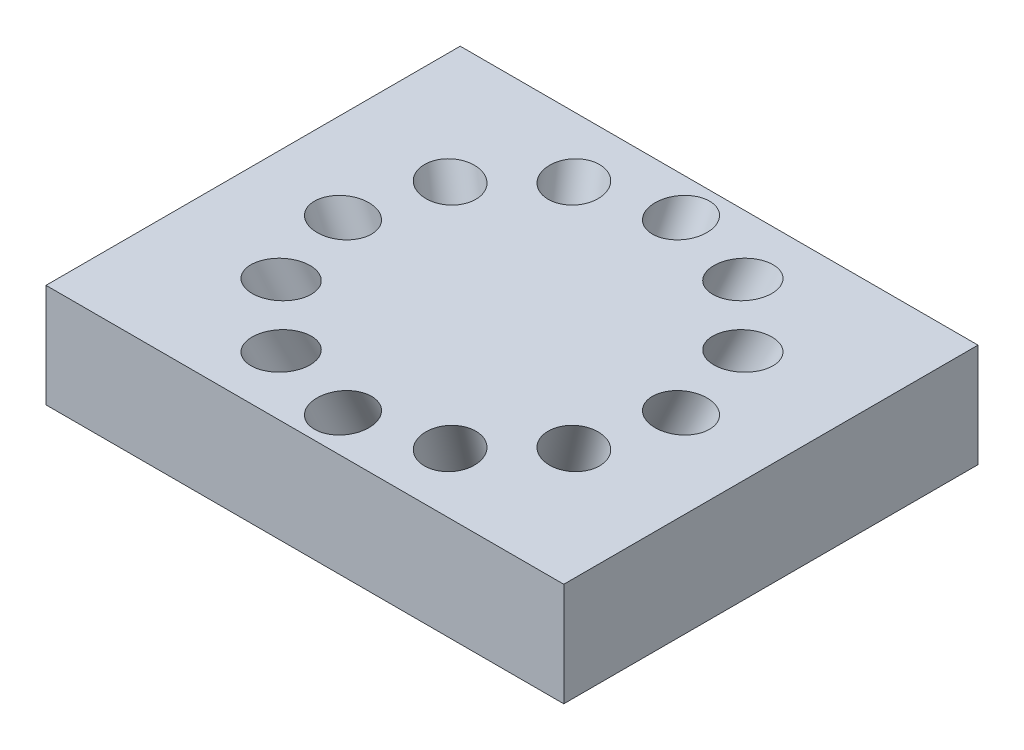
ISO-10303-21;
HEADER;
FILE_DESCRIPTION(('STEP AP214'),'2;1');
FILE_NAME('part.step','',(''),(''),'','','');
FILE_SCHEMA(('AUTOMOTIVE_DESIGN { 1 0 10303 214 1 1 1 1 }'));
ENDSEC;
DATA;
#1=APPLICATION_CONTEXT('core data for automotive mechanical design processes');
#2=APPLICATION_PROTOCOL_DEFINITION('international standard','automotive_design',2000,#1);
#3=PRODUCT_CONTEXT('',#1,'mechanical');
#4=PRODUCT('Part','Part','',(#3));
#5=PRODUCT_RELATED_PRODUCT_CATEGORY('part','',(#4));
#6=PRODUCT_DEFINITION_FORMATION('','',#4);
#7=PRODUCT_DEFINITION_CONTEXT('part definition',#1,'design');
#8=PRODUCT_DEFINITION('design','',#6,#7);
#9=PRODUCT_DEFINITION_SHAPE('','',#8);
#10=(LENGTH_UNIT() NAMED_UNIT(*) SI_UNIT(.MILLI.,.METRE.));
#11=(NAMED_UNIT(*) PLANE_ANGLE_UNIT() SI_UNIT($,.RADIAN.));
#12=(NAMED_UNIT(*) SI_UNIT($,.STERADIAN.) SOLID_ANGLE_UNIT());
#13=UNCERTAINTY_MEASURE_WITH_UNIT(LENGTH_MEASURE(1.E-05),#10,'distance_accuracy_value','');
#14=(GEOMETRIC_REPRESENTATION_CONTEXT(3) GLOBAL_UNCERTAINTY_ASSIGNED_CONTEXT((#13)) GLOBAL_UNIT_ASSIGNED_CONTEXT((#10,
#11,#12)) REPRESENTATION_CONTEXT('',''));
#15=CARTESIAN_POINT('',(0.,0.,0.));
#16=DIRECTION('',(0.,0.,1.));
#17=DIRECTION('',(1.,0.,0.));
#18=AXIS2_PLACEMENT_3D('',#15,#16,#17);
#19=CARTESIAN_POINT('',(50.,20.,-40.));
#20=DIRECTION('',(-1.,0.,0.));
#21=DIRECTION('',(0.,0.,1.));
#22=AXIS2_PLACEMENT_3D('',#19,#20,#21);
#23=PLANE('',#22);
#24=DIRECTION('',(0.,0.,-1.));
#25=VECTOR('',#24,1.);
#26=CARTESIAN_POINT('',(50.,0.,-40.));
#27=LINE('',#26,#25);
#28=CARTESIAN_POINT('',(50.,0.,40.));
#29=VERTEX_POINT('',#28);
#30=CARTESIAN_POINT('',(50.,0.,-40.));
#31=VERTEX_POINT('',#30);
#32=EDGE_CURVE('E101',#29,#31,#27,.T.);
#33=ORIENTED_EDGE('',*,*,#32,.T.);
#34=DIRECTION('',(0.,-1.,0.));
#35=VECTOR('',#34,1.);
#36=CARTESIAN_POINT('',(50.,20.,-40.));
#37=LINE('',#36,#35);
#38=CARTESIAN_POINT('',(50.,20.,-40.));
#39=VERTEX_POINT('',#38);
#40=EDGE_CURVE('E11',#39,#31,#37,.T.);
#41=ORIENTED_EDGE('',*,*,#40,.F.);
#42=DIRECTION('',(0.,0.,-1.));
#43=VECTOR('',#42,1.);
#44=CARTESIAN_POINT('',(50.,20.,-40.));
#45=LINE('',#44,#43);
#46=CARTESIAN_POINT('',(50.,20.,40.));
#47=VERTEX_POINT('',#46);
#48=EDGE_CURVE('E88',#47,#39,#45,.T.);
#49=ORIENTED_EDGE('',*,*,#48,.F.);
#50=DIRECTION('',(0.,-1.,0.));
#51=VECTOR('',#50,1.);
#52=CARTESIAN_POINT('',(50.,20.,40.));
#53=LINE('',#52,#51);
#54=EDGE_CURVE('E97',#47,#29,#53,.T.);
#55=ORIENTED_EDGE('',*,*,#54,.T.);
#56=EDGE_LOOP('',(#33,#41,#49,#55));
#57=FACE_BOUND('',#56,.T.);
#58=ADVANCED_FACE('F35',(#57),#23,.F.);
#59=CARTESIAN_POINT('',(-50.,20.,-40.));
#60=DIRECTION('',(0.,0.,1.));
#61=DIRECTION('',(1.,0.,0.));
#62=AXIS2_PLACEMENT_3D('',#59,#60,#61);
#63=PLANE('',#62);
#64=DIRECTION('',(-1.,0.,0.));
#65=VECTOR('',#64,1.);
#66=CARTESIAN_POINT('',(-50.,0.,-40.));
#67=LINE('',#66,#65);
#68=CARTESIAN_POINT('',(-50.,0.,-40.));
#69=VERTEX_POINT('',#68);
#70=EDGE_CURVE('E92',#31,#69,#67,.T.);
#71=ORIENTED_EDGE('',*,*,#70,.T.);
#72=DIRECTION('',(0.,-1.,0.));
#73=VECTOR('',#72,1.);
#74=CARTESIAN_POINT('',(-50.,20.,-40.));
#75=LINE('',#74,#73);
#76=CARTESIAN_POINT('',(-50.,20.,-40.));
#77=VERTEX_POINT('',#76);
#78=EDGE_CURVE('E44',#77,#69,#75,.T.);
#79=ORIENTED_EDGE('',*,*,#78,.F.);
#80=DIRECTION('',(-1.,0.,0.));
#81=VECTOR('',#80,1.);
#82=CARTESIAN_POINT('',(-50.,20.,-40.));
#83=LINE('',#82,#81);
#84=EDGE_CURVE('E83',#39,#77,#83,.T.);
#85=ORIENTED_EDGE('',*,*,#84,.F.);
#86=ORIENTED_EDGE('',*,*,#40,.T.);
#87=EDGE_LOOP('',(#71,#79,#85,#86));
#88=FACE_BOUND('',#87,.T.);
#89=ADVANCED_FACE('F91',(#88),#63,.F.);
#90=CARTESIAN_POINT('',(-50.,20.,-40.));
#91=DIRECTION('',(1.,0.,0.));
#92=DIRECTION('',(0.,0.,-1.));
#93=AXIS2_PLACEMENT_3D('',#90,#91,#92);
#94=PLANE('',#93);
#95=DIRECTION('',(0.,0.,1.));
#96=VECTOR('',#95,1.);
#97=CARTESIAN_POINT('',(-50.,0.,-40.));
#98=LINE('',#97,#96);
#99=CARTESIAN_POINT('',(-50.,0.,40.));
#100=VERTEX_POINT('',#99);
#101=EDGE_CURVE('E70',#69,#100,#98,.T.);
#102=ORIENTED_EDGE('',*,*,#101,.T.);
#103=DIRECTION('',(0.,-1.,0.));
#104=VECTOR('',#103,1.);
#105=CARTESIAN_POINT('',(-50.,20.,40.));
#106=LINE('',#105,#104);
#107=CARTESIAN_POINT('',(-50.,20.,40.));
#108=VERTEX_POINT('',#107);
#109=EDGE_CURVE('E93',#108,#100,#106,.T.);
#110=ORIENTED_EDGE('',*,*,#109,.F.);
#111=DIRECTION('',(0.,0.,1.));
#112=VECTOR('',#111,1.);
#113=CARTESIAN_POINT('',(-50.,20.,-40.));
#114=LINE('',#113,#112);
#115=EDGE_CURVE('E86',#77,#108,#114,.T.);
#116=ORIENTED_EDGE('',*,*,#115,.F.);
#117=ORIENTED_EDGE('',*,*,#78,.T.);
#118=EDGE_LOOP('',(#102,#110,#116,#117));
#119=FACE_BOUND('',#118,.T.);
#120=ADVANCED_FACE('F95',(#119),#94,.F.);
#121=CARTESIAN_POINT('',(-50.,20.,40.));
#122=DIRECTION('',(0.,0.,-1.));
#123=DIRECTION('',(-1.,0.,0.));
#124=AXIS2_PLACEMENT_3D('',#121,#122,#123);
#125=PLANE('',#124);
#126=DIRECTION('',(1.,0.,0.));
#127=VECTOR('',#126,1.);
#128=CARTESIAN_POINT('',(-50.,0.,40.));
#129=LINE('',#128,#127);
#130=EDGE_CURVE('E76',#100,#29,#129,.T.);
#131=ORIENTED_EDGE('',*,*,#130,.T.);
#132=ORIENTED_EDGE('',*,*,#54,.F.);
#133=DIRECTION('',(1.,0.,0.));
#134=VECTOR('',#133,1.);
#135=CARTESIAN_POINT('',(-50.,20.,40.));
#136=LINE('',#135,#134);
#137=EDGE_CURVE('E53',#108,#47,#136,.T.);
#138=ORIENTED_EDGE('',*,*,#137,.F.);
#139=ORIENTED_EDGE('',*,*,#109,.T.);
#140=EDGE_LOOP('',(#131,#132,#138,#139));
#141=FACE_BOUND('',#140,.T.);
#142=ADVANCED_FACE('F188',(#141),#125,.F.);
#143=CARTESIAN_POINT('',(0.,20.,0.));
#144=DIRECTION('',(0.,1.,0.));
#145=DIRECTION('',(0.,0.,1.));
#146=AXIS2_PLACEMENT_3D('',#143,#144,#145);
#147=PLANE('',#146);
#148=CARTESIAN_POINT('',(-28.2683994559019,20.,16.3207680354243));
#149=DIRECTION('',(0.,1.,0.));
#150=DIRECTION('',(0.866025403784445,0.,-0.499999999999989));
#151=AXIS2_PLACEMENT_3D('',#148,#149,#150);
#152=ELLIPSE('',#151,5.51688959481245,5.);
#153=CARTESIAN_POINT('',(-23.4906329169202,20.,13.5623232380182));
#154=VERTEX_POINT('',#153);
#155=EDGE_CURVE('E151',#154,#154,#152,.T.);
#156=ORIENTED_EDGE('',*,*,#155,.F.);
#157=EDGE_LOOP('',(#156));
#158=FACE_BOUND('',#157,.T.);
#159=CARTESIAN_POINT('',(-16.320768035425,20.,28.2683994559015));
#160=DIRECTION('',(0.,1.,0.));
#161=DIRECTION('',(0.50000000000001,0.,-0.866025403784433));
#162=AXIS2_PLACEMENT_3D('',#159,#160,#161);
#163=ELLIPSE('',#162,5.51688959481245,5.);
#164=CARTESIAN_POINT('',(-13.5623232380187,20.,23.4906329169199));
#165=VERTEX_POINT('',#164);
#166=EDGE_CURVE('E148',#165,#165,#163,.T.);
#167=ORIENTED_EDGE('',*,*,#166,.F.);
#168=EDGE_LOOP('',(#167));
#169=FACE_BOUND('',#168,.T.);
#170=CARTESIAN_POINT('',(-3.44399943993043E-13,20.,32.6415360708494));
#171=DIRECTION('',(0.,1.,0.));
#172=DIRECTION('',(0.,0.,-1.));
#173=AXIS2_PLACEMENT_3D('',#170,#171,#172);
#174=ELLIPSE('',#173,5.51688959481245,5.);
#175=CARTESIAN_POINT('',(-2.85135898830139E-13,20.,27.1246464760369));
#176=VERTEX_POINT('',#175);
#177=EDGE_CURVE('E145',#176,#176,#174,.T.);
#178=ORIENTED_EDGE('',*,*,#177,.F.);
#179=EDGE_LOOP('',(#178));
#180=FACE_BOUND('',#179,.T.);
#181=CARTESIAN_POINT('',(16.3207680354244,20.,28.2683994559018));
#182=DIRECTION('',(0.,1.,0.));
#183=DIRECTION('',(-0.499999999999992,0.,-0.866025403784443));
#184=AXIS2_PLACEMENT_3D('',#181,#182,#183);
#185=ELLIPSE('',#184,5.51688959481245,5.);
#186=CARTESIAN_POINT('',(13.5623232380182,20.,23.4906329169202));
#187=VERTEX_POINT('',#186);
#188=EDGE_CURVE('E141',#187,#187,#185,.T.);
#189=ORIENTED_EDGE('',*,*,#188,.F.);
#190=EDGE_LOOP('',(#189));
#191=FACE_BOUND('',#190,.T.);
#192=CARTESIAN_POINT('',(28.2683994559015,20.,16.3207680354249));
#193=DIRECTION('',(0.,1.,0.));
#194=DIRECTION('',(-0.866025403784434,0.,-0.500000000000007));
#195=AXIS2_PLACEMENT_3D('',#192,#193,#194);
#196=ELLIPSE('',#195,5.51688959481245,5.);
#197=CARTESIAN_POINT('',(23.4906329169199,20.,13.5623232380187));
#198=VERTEX_POINT('',#197);
#199=EDGE_CURVE('E137',#198,#198,#196,.T.);
#200=ORIENTED_EDGE('',*,*,#199,.F.);
#201=EDGE_LOOP('',(#200));
#202=FACE_BOUND('',#201,.T.);
#203=CARTESIAN_POINT('',(32.6415360708494,20.,0.));
#204=DIRECTION('',(0.,1.,0.));
#205=DIRECTION('',(-1.,0.,0.));
#206=AXIS2_PLACEMENT_3D('',#203,#204,#205);
#207=ELLIPSE('',#206,5.51688959481245,5.);
#208=CARTESIAN_POINT('',(27.1246464760369,20.,0.));
#209=VERTEX_POINT('',#208);
#210=EDGE_CURVE('E133',#209,#209,#207,.T.);
#211=ORIENTED_EDGE('',*,*,#210,.F.);
#212=EDGE_LOOP('',(#211));
#213=FACE_BOUND('',#212,.T.);
#214=CARTESIAN_POINT('',(28.2683994559017,20.,-16.3207680354245));
#215=DIRECTION('',(0.,1.,0.));
#216=DIRECTION('',(-0.866025403784442,0.,0.499999999999995));
#217=AXIS2_PLACEMENT_3D('',#214,#215,#216);
#218=ELLIPSE('',#217,5.51688959481245,5.);
#219=CARTESIAN_POINT('',(23.4906329169201,20.,-13.5623232380183));
#220=VERTEX_POINT('',#219);
#221=EDGE_CURVE('E129',#220,#220,#218,.T.);
#222=ORIENTED_EDGE('',*,*,#221,.F.);
#223=EDGE_LOOP('',(#222));
#224=FACE_BOUND('',#223,.T.);
#225=CARTESIAN_POINT('',(16.3207680354248,20.,-28.2683994559016));
#226=DIRECTION('',(0.,1.,0.));
#227=DIRECTION('',(-0.500000000000004,0.,0.866025403784436));
#228=AXIS2_PLACEMENT_3D('',#225,#226,#227);
#229=ELLIPSE('',#228,5.51688959481245,5.);
#230=CARTESIAN_POINT('',(13.5623232380186,20.,-23.49063291692));
#231=VERTEX_POINT('',#230);
#232=EDGE_CURVE('E125',#231,#231,#229,.T.);
#233=ORIENTED_EDGE('',*,*,#232,.F.);
#234=EDGE_LOOP('',(#233));
#235=FACE_BOUND('',#234,.T.);
#236=CARTESIAN_POINT('',(1.11469312257139E-13,20.,-32.6415360708494));
#237=DIRECTION('',(0.,1.,0.));
#238=DIRECTION('',(0.,0.,1.));
#239=AXIS2_PLACEMENT_3D('',#236,#237,#238);
#240=ELLIPSE('',#239,5.51688959481245,5.);
#241=CARTESIAN_POINT('',(0.,20.,-27.1246464760369));
#242=VERTEX_POINT('',#241);
#243=EDGE_CURVE('E121',#242,#242,#240,.T.);
#244=ORIENTED_EDGE('',*,*,#243,.F.);
#245=EDGE_LOOP('',(#244));
#246=FACE_BOUND('',#245,.T.);
#247=CARTESIAN_POINT('',(-16.3207680354246,20.,-28.2683994559017));
#248=DIRECTION('',(0.,1.,0.));
#249=DIRECTION('',(0.499999999999998,0.,0.86602540378444));
#250=AXIS2_PLACEMENT_3D('',#247,#248,#249);
#251=ELLIPSE('',#250,5.51688959481245,5.);
#252=CARTESIAN_POINT('',(-13.5623232380184,20.,-23.4906329169201));
#253=VERTEX_POINT('',#252);
#254=EDGE_CURVE('E117',#253,#253,#251,.T.);
#255=ORIENTED_EDGE('',*,*,#254,.F.);
#256=EDGE_LOOP('',(#255));
#257=FACE_BOUND('',#256,.T.);
#258=CARTESIAN_POINT('',(-28.2683994559016,20.,-16.3207680354247));
#259=DIRECTION('',(0.,1.,0.));
#260=DIRECTION('',(0.866025403784438,0.,0.500000000000001));
#261=AXIS2_PLACEMENT_3D('',#258,#259,#260);
#262=ELLIPSE('',#261,5.51688959481245,5.);
#263=CARTESIAN_POINT('',(-23.49063291692,20.,-13.5623232380185));
#264=VERTEX_POINT('',#263);
#265=EDGE_CURVE('E113',#264,#264,#262,.T.);
#266=ORIENTED_EDGE('',*,*,#265,.F.);
#267=EDGE_LOOP('',(#266));
#268=FACE_BOUND('',#267,.T.);
#269=CARTESIAN_POINT('',(-32.6415360708494,20.,0.));
#270=DIRECTION('',(0.,1.,0.));
#271=DIRECTION('',(1.,0.,0.));
#272=AXIS2_PLACEMENT_3D('',#269,#270,#271);
#273=ELLIPSE('',#272,5.51688959481245,5.);
#274=CARTESIAN_POINT('',(-27.1246464760369,20.,0.));
#275=VERTEX_POINT('',#274);
#276=EDGE_CURVE('E104',#275,#275,#273,.T.);
#277=ORIENTED_EDGE('',*,*,#276,.F.);
#278=EDGE_LOOP('',(#277));
#279=FACE_BOUND('',#278,.T.);
#280=ORIENTED_EDGE('',*,*,#48,.T.);
#281=ORIENTED_EDGE('',*,*,#84,.T.);
#282=ORIENTED_EDGE('',*,*,#115,.T.);
#283=ORIENTED_EDGE('',*,*,#137,.T.);
#284=EDGE_LOOP('',(#280,#281,#282,#283));
#285=FACE_BOUND('',#284,.T.);
#286=ADVANCED_FACE('F84',(#158,#169,#180,#191,#202,#213,#224,#235,#246,#257,#268,#279,#285),
#147,.T.);
#287=CARTESIAN_POINT('',(0.,0.,0.));
#288=DIRECTION('',(0.,1.,0.));
#289=DIRECTION('',(0.,0.,1.));
#290=AXIS2_PLACEMENT_3D('',#287,#288,#289);
#291=PLANE('',#290);
#292=CARTESIAN_POINT('',(-20.1917138970728,0.,11.6576914538745));
#293=DIRECTION('',(0.,1.,0.));
#294=DIRECTION('',(0.866025403784445,0.,-0.499999999999989));
#295=AXIS2_PLACEMENT_3D('',#292,#293,#294);
#296=ELLIPSE('',#295,5.51688959481245,5.);
#297=CARTESIAN_POINT('',(-15.4139473580911,0.,8.89924665646835));
#298=VERTEX_POINT('',#297);
#299=EDGE_CURVE('E38',#298,#298,#296,.T.);
#300=ORIENTED_EDGE('',*,*,#299,.T.);
#301=EDGE_LOOP('',(#300));
#302=FACE_BOUND('',#301,.T.);
#303=CARTESIAN_POINT('',(-11.657691453875,0.,20.1917138970725));
#304=DIRECTION('',(0.,1.,0.));
#305=DIRECTION('',(0.50000000000001,0.,-0.866025403784433));
#306=AXIS2_PLACEMENT_3D('',#303,#304,#305);
#307=ELLIPSE('',#306,5.51688959481245,5.);
#308=CARTESIAN_POINT('',(-8.89924665646873,0.,15.4139473580909));
#309=VERTEX_POINT('',#308);
#310=EDGE_CURVE('E149',#309,#309,#307,.T.);
#311=ORIENTED_EDGE('',*,*,#310,.T.);
#312=EDGE_LOOP('',(#311));
#313=FACE_BOUND('',#312,.T.);
#314=CARTESIAN_POINT('',(-2.44215672991169E-13,0.,23.3153829077496));
#315=DIRECTION('',(0.,1.,0.));
#316=DIRECTION('',(0.,0.,-1.));
#317=AXIS2_PLACEMENT_3D('',#314,#315,#316);
#318=ELLIPSE('',#317,5.51688959481245,5.);
#319=CARTESIAN_POINT('',(-1.84951627828265E-13,0.,17.7984933129371));
#320=VERTEX_POINT('',#319);
#321=EDGE_CURVE('E146',#320,#320,#318,.T.);
#322=ORIENTED_EDGE('',*,*,#321,.T.);
#323=EDGE_LOOP('',(#322));
#324=FACE_BOUND('',#323,.T.);
#325=CARTESIAN_POINT('',(11.6576914538746,0.,20.1917138970727));
#326=DIRECTION('',(0.,1.,0.));
#327=DIRECTION('',(-0.499999999999992,0.,-0.866025403784443));
#328=AXIS2_PLACEMENT_3D('',#325,#326,#327);
#329=ELLIPSE('',#328,5.51688959481245,5.);
#330=CARTESIAN_POINT('',(8.89924665646841,0.,15.4139473580911));
#331=VERTEX_POINT('',#330);
#332=EDGE_CURVE('E142',#331,#331,#329,.T.);
#333=ORIENTED_EDGE('',*,*,#332,.T.);
#334=EDGE_LOOP('',(#333));
#335=FACE_BOUND('',#334,.T.);
#336=CARTESIAN_POINT('',(20.1917138970725,0.,11.6576914538749));
#337=DIRECTION('',(0.,1.,0.));
#338=DIRECTION('',(-0.866025403784434,0.,-0.500000000000007));
#339=AXIS2_PLACEMENT_3D('',#336,#337,#338);
#340=ELLIPSE('',#339,5.51688959481245,5.);
#341=CARTESIAN_POINT('',(15.4139473580909,0.,8.89924665646868));
#342=VERTEX_POINT('',#341);
#343=EDGE_CURVE('E138',#342,#342,#340,.T.);
#344=ORIENTED_EDGE('',*,*,#343,.T.);
#345=EDGE_LOOP('',(#344));
#346=FACE_BOUND('',#345,.T.);
#347=CARTESIAN_POINT('',(23.3153829077496,0.,0.));
#348=DIRECTION('',(0.,1.,0.));
#349=DIRECTION('',(-1.,0.,0.));
#350=AXIS2_PLACEMENT_3D('',#347,#348,#349);
#351=ELLIPSE('',#350,5.51688959481245,5.);
#352=CARTESIAN_POINT('',(17.7984933129371,0.,0.));
#353=VERTEX_POINT('',#352);
#354=EDGE_CURVE('E134',#353,#353,#351,.T.);
#355=ORIENTED_EDGE('',*,*,#354,.T.);
#356=EDGE_LOOP('',(#355));
#357=FACE_BOUND('',#356,.T.);
#358=CARTESIAN_POINT('',(20.1917138970727,0.,-11.6576914538747));
#359=DIRECTION('',(0.,1.,0.));
#360=DIRECTION('',(-0.866025403784442,0.,0.499999999999995));
#361=AXIS2_PLACEMENT_3D('',#358,#359,#360);
#362=ELLIPSE('',#361,5.51688959481245,5.);
#363=CARTESIAN_POINT('',(15.413947358091,0.,-8.89924665646846));
#364=VERTEX_POINT('',#363);
#365=EDGE_CURVE('E130',#364,#364,#362,.T.);
#366=ORIENTED_EDGE('',*,*,#365,.T.);
#367=EDGE_LOOP('',(#366));
#368=FACE_BOUND('',#367,.T.);
#369=CARTESIAN_POINT('',(11.6576914538749,0.,-20.1917138970726));
#370=DIRECTION('',(0.,1.,0.));
#371=DIRECTION('',(-0.500000000000004,0.,0.866025403784436));
#372=AXIS2_PLACEMENT_3D('',#369,#370,#371);
#373=ELLIPSE('',#372,5.51688959481245,5.);
#374=CARTESIAN_POINT('',(8.89924665646863,0.,-15.4139473580909));
#375=VERTEX_POINT('',#374);
#376=EDGE_CURVE('E126',#375,#375,#373,.T.);
#377=ORIENTED_EDGE('',*,*,#376,.T.);
#378=EDGE_LOOP('',(#377));
#379=FACE_BOUND('',#378,.T.);
#380=CARTESIAN_POINT('',(0.,0.,-23.3153829077496));
#381=DIRECTION('',(0.,1.,0.));
#382=DIRECTION('',(0.,0.,1.));
#383=AXIS2_PLACEMENT_3D('',#380,#381,#382);
#384=ELLIPSE('',#383,5.51688959481245,5.);
#385=CARTESIAN_POINT('',(0.,0.,-17.7984933129371));
#386=VERTEX_POINT('',#385);
#387=EDGE_CURVE('E122',#386,#386,#384,.T.);
#388=ORIENTED_EDGE('',*,*,#387,.T.);
#389=EDGE_LOOP('',(#388));
#390=FACE_BOUND('',#389,.T.);
#391=CARTESIAN_POINT('',(-11.6576914538747,0.,-20.1917138970726));
#392=DIRECTION('',(0.,1.,0.));
#393=DIRECTION('',(0.499999999999998,0.,0.86602540378444));
#394=AXIS2_PLACEMENT_3D('',#391,#392,#393);
#395=ELLIPSE('',#394,5.51688959481245,5.);
#396=CARTESIAN_POINT('',(-8.89924665646851,0.,-15.413947358091));
#397=VERTEX_POINT('',#396);
#398=EDGE_CURVE('E118',#397,#397,#395,.T.);
#399=ORIENTED_EDGE('',*,*,#398,.T.);
#400=EDGE_LOOP('',(#399));
#401=FACE_BOUND('',#400,.T.);
#402=CARTESIAN_POINT('',(-20.1917138970726,0.,-11.6576914538748));
#403=DIRECTION('',(0.,1.,0.));
#404=DIRECTION('',(0.866025403784438,0.,0.500000000000001));
#405=AXIS2_PLACEMENT_3D('',#402,#403,#404);
#406=ELLIPSE('',#405,5.51688959481245,5.);
#407=CARTESIAN_POINT('',(-15.413947358091,0.,-8.89924665646857));
#408=VERTEX_POINT('',#407);
#409=EDGE_CURVE('E114',#408,#408,#406,.T.);
#410=ORIENTED_EDGE('',*,*,#409,.T.);
#411=EDGE_LOOP('',(#410));
#412=FACE_BOUND('',#411,.T.);
#413=CARTESIAN_POINT('',(-23.3153829077496,0.,0.));
#414=DIRECTION('',(0.,1.,0.));
#415=DIRECTION('',(1.,0.,0.));
#416=AXIS2_PLACEMENT_3D('',#413,#414,#415);
#417=ELLIPSE('',#416,5.51688959481245,5.);
#418=CARTESIAN_POINT('',(-17.7984933129371,0.,0.));
#419=VERTEX_POINT('',#418);
#420=EDGE_CURVE('E110',#419,#419,#417,.T.);
#421=ORIENTED_EDGE('',*,*,#420,.T.);
#422=EDGE_LOOP('',(#421));
#423=FACE_BOUND('',#422,.T.);
#424=ORIENTED_EDGE('',*,*,#32,.F.);
#425=ORIENTED_EDGE('',*,*,#130,.F.);
#426=ORIENTED_EDGE('',*,*,#101,.F.);
#427=ORIENTED_EDGE('',*,*,#70,.F.);
#428=EDGE_LOOP('',(#424,#425,#426,#427));
#429=FACE_BOUND('',#428,.T.);
#430=ADVANCED_FACE('F187',(#302,#313,#324,#335,#346,#357,#368,#379,#390,#401,#412,#423,#429),
#291,.F.);
#431=CARTESIAN_POINT('',(0.,-50.,0.));
#432=DIRECTION('',(0.422618261740694,-0.906307787036652,0.));
#433=DIRECTION('',(0.906307787036652,0.422618261740694,0.));
#434=AXIS2_PLACEMENT_3D('',#431,#432,#433);
#435=CYLINDRICAL_SURFACE('',#434,5.);
#436=ORIENTED_EDGE('',*,*,#276,.T.);
#437=EDGE_LOOP('',(#436));
#438=FACE_BOUND('',#437,.T.);
#439=ORIENTED_EDGE('',*,*,#420,.F.);
#440=EDGE_LOOP('',(#439));
#441=FACE_BOUND('',#440,.T.);
#442=ADVANCED_FACE('F183',(#438,#441),#435,.F.);
#443=CARTESIAN_POINT('',(0.,-50.,0.));
#444=DIRECTION('',(0.365998150770662,-0.906307787036652,0.211309130870347));
#445=DIRECTION('',(0.784885567221397,0.422618261740694,0.453153893518327));
#446=AXIS2_PLACEMENT_3D('',#443,#444,#445);
#447=CYLINDRICAL_SURFACE('',#446,5.);
#448=ORIENTED_EDGE('',*,*,#265,.T.);
#449=EDGE_LOOP('',(#448));
#450=FACE_BOUND('',#449,.T.);
#451=ORIENTED_EDGE('',*,*,#409,.F.);
#452=EDGE_LOOP('',(#451));
#453=FACE_BOUND('',#452,.T.);
#454=ADVANCED_FACE('F226',(#450,#453),#447,.F.);
#455=CARTESIAN_POINT('',(0.,-50.,0.));
#456=DIRECTION('',(0.211309130870346,-0.906307787036652,0.365998150770662));
#457=DIRECTION('',(0.453153893518324,0.422618261740694,0.784885567221399));
#458=AXIS2_PLACEMENT_3D('',#455,#456,#457);
#459=CYLINDRICAL_SURFACE('',#458,5.);
#460=ORIENTED_EDGE('',*,*,#254,.T.);
#461=EDGE_LOOP('',(#460));
#462=FACE_BOUND('',#461,.T.);
#463=ORIENTED_EDGE('',*,*,#398,.F.);
#464=EDGE_LOOP('',(#463));
#465=FACE_BOUND('',#464,.T.);
#466=ADVANCED_FACE('F244',(#462,#465),#459,.F.);
#467=CARTESIAN_POINT('',(0.,-50.,0.));
#468=DIRECTION('',(0.,-0.906307787036652,0.422618261740694));
#469=DIRECTION('',(0.,0.422618261740694,0.906307787036652));
#470=AXIS2_PLACEMENT_3D('',#467,#468,#469);
#471=CYLINDRICAL_SURFACE('',#470,5.);
#472=ORIENTED_EDGE('',*,*,#243,.T.);
#473=EDGE_LOOP('',(#472));
#474=FACE_BOUND('',#473,.T.);
#475=ORIENTED_EDGE('',*,*,#387,.F.);
#476=EDGE_LOOP('',(#475));
#477=FACE_BOUND('',#476,.T.);
#478=ADVANCED_FACE('F254',(#474,#477),#471,.F.);
#479=CARTESIAN_POINT('',(0.,-50.,0.));
#480=DIRECTION('',(-0.211309130870349,-0.906307787036653,0.365998150770661));
#481=DIRECTION('',(-0.45315389351833,0.422618261740694,0.784885567221396));
#482=AXIS2_PLACEMENT_3D('',#479,#480,#481);
#483=CYLINDRICAL_SURFACE('',#482,5.);
#484=ORIENTED_EDGE('',*,*,#232,.T.);
#485=EDGE_LOOP('',(#484));
#486=FACE_BOUND('',#485,.T.);
#487=ORIENTED_EDGE('',*,*,#376,.F.);
#488=EDGE_LOOP('',(#487));
#489=FACE_BOUND('',#488,.T.);
#490=ADVANCED_FACE('F264',(#486,#489),#483,.F.);
#491=CARTESIAN_POINT('',(0.,-50.,0.));
#492=DIRECTION('',(-0.365998150770663,-0.906307787036653,0.211309130870345));
#493=DIRECTION('',(-0.784885567221401,0.422618261740694,0.453153893518322));
#494=AXIS2_PLACEMENT_3D('',#491,#492,#493);
#495=CYLINDRICAL_SURFACE('',#494,5.);
#496=ORIENTED_EDGE('',*,*,#221,.T.);
#497=EDGE_LOOP('',(#496));
#498=FACE_BOUND('',#497,.T.);
#499=ORIENTED_EDGE('',*,*,#365,.F.);
#500=EDGE_LOOP('',(#499));
#501=FACE_BOUND('',#500,.T.);
#502=ADVANCED_FACE('F274',(#498,#501),#495,.F.);
#503=CARTESIAN_POINT('',(0.,-50.,0.));
#504=DIRECTION('',(-0.422618261740694,-0.906307787036653,0.));
#505=DIRECTION('',(-0.906307787036653,0.422618261740694,0.));
#506=AXIS2_PLACEMENT_3D('',#503,#504,#505);
#507=CYLINDRICAL_SURFACE('',#506,5.);
#508=ORIENTED_EDGE('',*,*,#210,.T.);
#509=EDGE_LOOP('',(#508));
#510=FACE_BOUND('',#509,.T.);
#511=ORIENTED_EDGE('',*,*,#354,.F.);
#512=EDGE_LOOP('',(#511));
#513=FACE_BOUND('',#512,.T.);
#514=ADVANCED_FACE('F284',(#510,#513),#507,.F.);
#515=CARTESIAN_POINT('',(0.,-50.,0.));
#516=DIRECTION('',(-0.36599815077066,-0.906307787036653,-0.21130913087035));
#517=DIRECTION('',(-0.784885567221394,0.422618261740694,-0.453153893518333));
#518=AXIS2_PLACEMENT_3D('',#515,#516,#517);
#519=CYLINDRICAL_SURFACE('',#518,5.);
#520=ORIENTED_EDGE('',*,*,#199,.T.);
#521=EDGE_LOOP('',(#520));
#522=FACE_BOUND('',#521,.T.);
#523=ORIENTED_EDGE('',*,*,#343,.F.);
#524=EDGE_LOOP('',(#523));
#525=FACE_BOUND('',#524,.T.);
#526=ADVANCED_FACE('F294',(#522,#525),#519,.F.);
#527=CARTESIAN_POINT('',(0.,-50.,0.));
#528=DIRECTION('',(-0.211309130870343,-0.906307787036653,-0.365998150770664));
#529=DIRECTION('',(-0.453153893518319,0.422618261740694,-0.784885567221402));
#530=AXIS2_PLACEMENT_3D('',#527,#528,#529);
#531=CYLINDRICAL_SURFACE('',#530,5.);
#532=ORIENTED_EDGE('',*,*,#188,.T.);
#533=EDGE_LOOP('',(#532));
#534=FACE_BOUND('',#533,.T.);
#535=ORIENTED_EDGE('',*,*,#332,.F.);
#536=EDGE_LOOP('',(#535));
#537=FACE_BOUND('',#536,.T.);
#538=ADVANCED_FACE('F304',(#534,#537),#531,.F.);
#539=CARTESIAN_POINT('',(0.,-50.,0.));
#540=DIRECTION('',(0.,-0.906307787036652,-0.422618261740694));
#541=DIRECTION('',(0.,0.422618261740694,-0.906307787036652));
#542=AXIS2_PLACEMENT_3D('',#539,#540,#541);
#543=CYLINDRICAL_SURFACE('',#542,5.);
#544=ORIENTED_EDGE('',*,*,#177,.T.);
#545=EDGE_LOOP('',(#544));
#546=FACE_BOUND('',#545,.T.);
#547=ORIENTED_EDGE('',*,*,#321,.F.);
#548=EDGE_LOOP('',(#547));
#549=FACE_BOUND('',#548,.T.);
#550=ADVANCED_FACE('F314',(#546,#549),#543,.F.);
#551=CARTESIAN_POINT('',(0.,-50.,0.));
#552=DIRECTION('',(0.211309130870351,-0.906307787036652,-0.365998150770659));
#553=DIRECTION('',(0.453153893518335,0.422618261740694,-0.784885567221393));
#554=AXIS2_PLACEMENT_3D('',#551,#552,#553);
#555=CYLINDRICAL_SURFACE('',#554,5.);
#556=ORIENTED_EDGE('',*,*,#166,.T.);
#557=EDGE_LOOP('',(#556));
#558=FACE_BOUND('',#557,.T.);
#559=ORIENTED_EDGE('',*,*,#310,.F.);
#560=EDGE_LOOP('',(#559));
#561=FACE_BOUND('',#560,.T.);
#562=ADVANCED_FACE('F324',(#558,#561),#555,.F.);
#563=CARTESIAN_POINT('',(0.,-50.,0.));
#564=DIRECTION('',(0.365998150770665,-0.906307787036652,-0.211309130870342));
#565=DIRECTION('',(0.784885567221404,0.422618261740694,-0.453153893518316));
#566=AXIS2_PLACEMENT_3D('',#563,#564,#565);
#567=CYLINDRICAL_SURFACE('',#566,5.);
#568=ORIENTED_EDGE('',*,*,#155,.T.);
#569=EDGE_LOOP('',(#568));
#570=FACE_BOUND('',#569,.T.);
#571=ORIENTED_EDGE('',*,*,#299,.F.);
#572=EDGE_LOOP('',(#571));
#573=FACE_BOUND('',#572,.T.);
#574=ADVANCED_FACE('F334',(#570,#573),#567,.F.);
#575=CLOSED_SHELL('',(#58,#89,#120,#142,#286,#430,#442,#454,#466,#478,#490,#502,#514,#526,#538,
#550,#562,#574));
#576=MANIFOLD_SOLID_BREP('B2',#575);
#577=ADVANCED_BREP_SHAPE_REPRESENTATION('',(#18,#576),#14);
#578=SHAPE_DEFINITION_REPRESENTATION(#9,#577);
ENDSEC;
END-ISO-10303-21;
